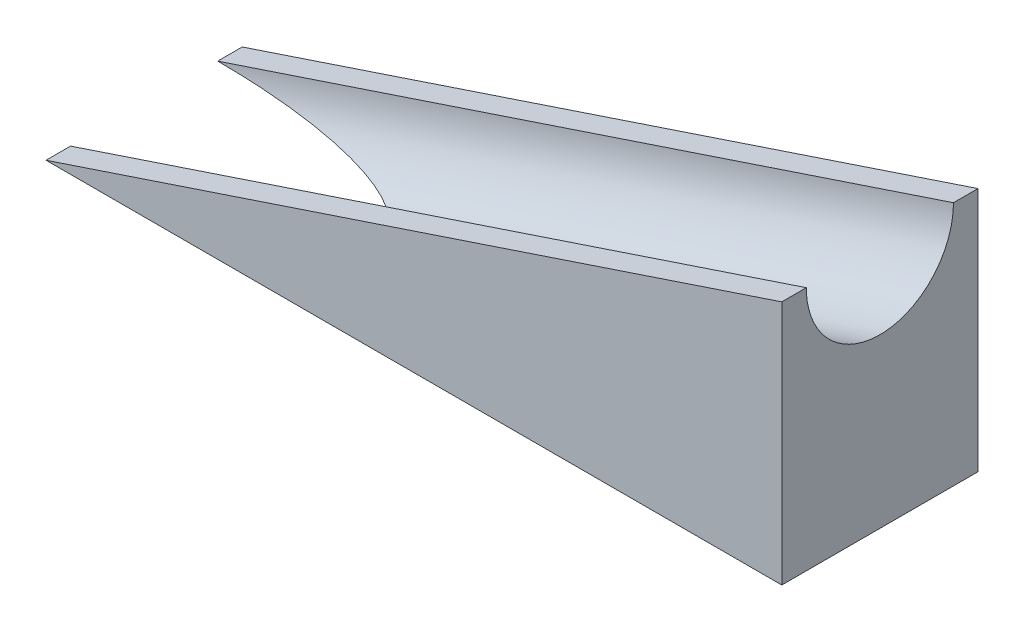
ISO-10303-21;
HEADER;
FILE_DESCRIPTION(('STEP AP214'),'2;1');
FILE_NAME('part.step','',(''),(''),'','','');
FILE_SCHEMA(('AUTOMOTIVE_DESIGN { 1 0 10303 214 1 1 1 1 }'));
ENDSEC;
DATA;
#1=APPLICATION_CONTEXT('core data for automotive mechanical design processes');
#2=APPLICATION_PROTOCOL_DEFINITION('international standard','automotive_design',2000,#1);
#3=PRODUCT_CONTEXT('',#1,'mechanical');
#4=PRODUCT('Part','Part','',(#3));
#5=PRODUCT_RELATED_PRODUCT_CATEGORY('part','',(#4));
#6=PRODUCT_DEFINITION_FORMATION('','',#4);
#7=PRODUCT_DEFINITION_CONTEXT('part definition',#1,'design');
#8=PRODUCT_DEFINITION('design','',#6,#7);
#9=PRODUCT_DEFINITION_SHAPE('','',#8);
#10=(LENGTH_UNIT() NAMED_UNIT(*) SI_UNIT(.MILLI.,.METRE.));
#11=(NAMED_UNIT(*) PLANE_ANGLE_UNIT() SI_UNIT($,.RADIAN.));
#12=(NAMED_UNIT(*) SI_UNIT($,.STERADIAN.) SOLID_ANGLE_UNIT());
#13=UNCERTAINTY_MEASURE_WITH_UNIT(LENGTH_MEASURE(1.E-05),#10,'distance_accuracy_value','');
#14=(GEOMETRIC_REPRESENTATION_CONTEXT(3) GLOBAL_UNCERTAINTY_ASSIGNED_CONTEXT((#13)) GLOBAL_UNIT_ASSIGNED_CONTEXT((#10,
#11,#12)) REPRESENTATION_CONTEXT('',''));
#15=CARTESIAN_POINT('',(0.,0.,0.));
#16=DIRECTION('',(0.,0.,1.));
#17=DIRECTION('',(1.,0.,0.));
#18=AXIS2_PLACEMENT_3D('',#15,#16,#17);
#19=CARTESIAN_POINT('',(150.,50.,40.));
#20=DIRECTION('',(0.316227766016838,-0.948683298050514,0.));
#21=DIRECTION('',(0.948683298050514,0.316227766016838,0.));
#22=AXIS2_PLACEMENT_3D('',#19,#20,#21);
#23=PLANE('',#22);
#24=DIRECTION('',(0.,0.,-1.));
#25=VECTOR('',#24,1.);
#26=CARTESIAN_POINT('',(150.,50.,40.));
#27=LINE('',#26,#25);
#28=CARTESIAN_POINT('',(150.,50.,40.));
#29=VERTEX_POINT('',#28);
#30=CARTESIAN_POINT('',(150.,50.,35.));
#31=VERTEX_POINT('',#30);
#32=EDGE_CURVE('E120',#29,#31,#27,.T.);
#33=ORIENTED_EDGE('',*,*,#32,.T.);
#34=DIRECTION('',(-0.948683298050514,-0.316227766016838,0.));
#35=VECTOR('',#34,1.);
#36=CARTESIAN_POINT('',(155.748623440674,51.916207813558,35.));
#37=LINE('',#36,#35);
#38=CARTESIAN_POINT('',(0.,0.,35.));
#39=VERTEX_POINT('',#38);
#40=EDGE_CURVE('E11',#31,#39,#37,.T.);
#41=ORIENTED_EDGE('',*,*,#40,.T.);
#42=DIRECTION('',(0.,0.,-1.));
#43=VECTOR('',#42,1.);
#44=CARTESIAN_POINT('',(0.,0.,40.));
#45=LINE('',#44,#43);
#46=CARTESIAN_POINT('',(0.,0.,40.));
#47=VERTEX_POINT('',#46);
#48=EDGE_CURVE('E103',#47,#39,#45,.T.);
#49=ORIENTED_EDGE('',*,*,#48,.F.);
#50=DIRECTION('',(-0.948683298050514,-0.316227766016838,0.));
#51=VECTOR('',#50,1.);
#52=CARTESIAN_POINT('',(150.,50.,40.));
#53=LINE('',#52,#51);
#54=EDGE_CURVE('E64',#29,#47,#53,.T.);
#55=ORIENTED_EDGE('',*,*,#54,.F.);
#56=EDGE_LOOP('',(#33,#41,#49,#55));
#57=FACE_BOUND('',#56,.T.);
#58=ADVANCED_FACE('F39',(#57),#23,.F.);
#59=CARTESIAN_POINT('',(0.,0.,40.));
#60=DIRECTION('',(0.,1.,0.));
#61=DIRECTION('',(0.,0.,1.));
#62=AXIS2_PLACEMENT_3D('',#59,#60,#61);
#63=PLANE('',#62);
#64=ORIENTED_EDGE('',*,*,#48,.T.);
#65=CARTESIAN_POINT('',(-5.27355936696949E-13,0.,20.));
#66=DIRECTION('',(0.,1.,0.));
#67=DIRECTION('',(-1.,0.,0.));
#68=AXIS2_PLACEMENT_3D('',#65,#66,#67);
#69=ELLIPSE('',#68,47.4341649025257,15.);
#70=CARTESIAN_POINT('',(0.,0.,5.));
#71=VERTEX_POINT('',#70);
#72=EDGE_CURVE('E96',#71,#39,#69,.F.);
#73=ORIENTED_EDGE('',*,*,#72,.F.);
#74=CARTESIAN_POINT('',(0.,0.,0.));
#75=VERTEX_POINT('',#74);
#76=EDGE_CURVE('E82',#71,#75,#45,.T.);
#77=ORIENTED_EDGE('',*,*,#76,.T.);
#78=DIRECTION('',(1.,0.,0.));
#79=VECTOR('',#78,1.);
#80=CARTESIAN_POINT('',(0.,0.,0.));
#81=LINE('',#80,#79);
#82=CARTESIAN_POINT('',(150.,0.,0.));
#83=VERTEX_POINT('',#82);
#84=EDGE_CURVE('E105',#75,#83,#81,.T.);
#85=ORIENTED_EDGE('',*,*,#84,.T.);
#86=DIRECTION('',(0.,0.,-1.));
#87=VECTOR('',#86,1.);
#88=CARTESIAN_POINT('',(150.,0.,40.));
#89=LINE('',#88,#87);
#90=CARTESIAN_POINT('',(150.,0.,40.));
#91=VERTEX_POINT('',#90);
#92=EDGE_CURVE('E100',#91,#83,#89,.T.);
#93=ORIENTED_EDGE('',*,*,#92,.F.);
#94=DIRECTION('',(1.,0.,0.));
#95=VECTOR('',#94,1.);
#96=CARTESIAN_POINT('',(0.,0.,40.));
#97=LINE('',#96,#95);
#98=EDGE_CURVE('E136',#47,#91,#97,.T.);
#99=ORIENTED_EDGE('',*,*,#98,.F.);
#100=EDGE_LOOP('',(#64,#73,#77,#85,#93,#99));
#101=FACE_BOUND('',#100,.T.);
#102=ADVANCED_FACE('F41',(#101),#63,.F.);
#103=CARTESIAN_POINT('',(150.,0.,40.));
#104=DIRECTION('',(-1.,0.,0.));
#105=DIRECTION('',(0.,0.,1.));
#106=AXIS2_PLACEMENT_3D('',#103,#104,#105);
#107=PLANE('',#106);
#108=CARTESIAN_POINT('',(150.,50.,5.));
#109=VERTEX_POINT('',#108);
#110=CARTESIAN_POINT('',(150.,50.,0.));
#111=VERTEX_POINT('',#110);
#112=EDGE_CURVE('E115',#109,#111,#27,.T.);
#113=ORIENTED_EDGE('',*,*,#112,.F.);
#114=CARTESIAN_POINT('',(150.,50.0000000000002,20.));
#115=DIRECTION('',(-1.,0.,0.));
#116=DIRECTION('',(0.,-1.,0.));
#117=AXIS2_PLACEMENT_3D('',#114,#115,#116);
#118=ELLIPSE('',#117,15.8113883008419,15.);
#119=EDGE_CURVE('E55',#31,#109,#118,.F.);
#120=ORIENTED_EDGE('',*,*,#119,.F.);
#121=ORIENTED_EDGE('',*,*,#32,.F.);
#122=DIRECTION('',(0.,1.,0.));
#123=VECTOR('',#122,1.);
#124=CARTESIAN_POINT('',(150.,0.,40.));
#125=LINE('',#124,#123);
#126=EDGE_CURVE('E88',#91,#29,#125,.T.);
#127=ORIENTED_EDGE('',*,*,#126,.F.);
#128=ORIENTED_EDGE('',*,*,#92,.T.);
#129=DIRECTION('',(0.,1.,0.));
#130=VECTOR('',#129,1.);
#131=CARTESIAN_POINT('',(150.,0.,0.));
#132=LINE('',#131,#130);
#133=EDGE_CURVE('E128',#83,#111,#132,.T.);
#134=ORIENTED_EDGE('',*,*,#133,.T.);
#135=EDGE_LOOP('',(#113,#120,#121,#127,#128,#134));
#136=FACE_BOUND('',#135,.T.);
#137=ADVANCED_FACE('F127',(#136),#107,.F.);
#138=ORIENTED_EDGE('',*,*,#76,.F.);
#139=DIRECTION('',(-0.948683298050514,-0.316227766016838,0.));
#140=VECTOR('',#139,1.);
#141=CARTESIAN_POINT('',(155.748623440674,51.916207813558,5.));
#142=LINE('',#141,#140);
#143=EDGE_CURVE('E48',#71,#109,#142,.F.);
#144=ORIENTED_EDGE('',*,*,#143,.T.);
#145=ORIENTED_EDGE('',*,*,#112,.T.);
#146=DIRECTION('',(-0.948683298050514,-0.316227766016838,0.));
#147=VECTOR('',#146,1.);
#148=CARTESIAN_POINT('',(150.,50.,0.));
#149=LINE('',#148,#147);
#150=EDGE_CURVE('E109',#111,#75,#149,.T.);
#151=ORIENTED_EDGE('',*,*,#150,.T.);
#152=EDGE_LOOP('',(#138,#144,#145,#151));
#153=FACE_BOUND('',#152,.T.);
#154=ADVANCED_FACE('F107',(#153),#23,.F.);
#155=CARTESIAN_POINT('',(0.,0.,40.));
#156=DIRECTION('',(0.,0.,1.));
#157=DIRECTION('',(1.,0.,0.));
#158=AXIS2_PLACEMENT_3D('',#155,#156,#157);
#159=PLANE('',#158);
#160=ORIENTED_EDGE('',*,*,#98,.T.);
#161=ORIENTED_EDGE('',*,*,#126,.T.);
#162=ORIENTED_EDGE('',*,*,#54,.T.);
#163=EDGE_LOOP('',(#160,#161,#162));
#164=FACE_BOUND('',#163,.T.);
#165=ADVANCED_FACE('F141',(#164),#159,.T.);
#166=CARTESIAN_POINT('',(0.,0.,0.));
#167=DIRECTION('',(0.,0.,1.));
#168=DIRECTION('',(1.,0.,0.));
#169=AXIS2_PLACEMENT_3D('',#166,#167,#168);
#170=PLANE('',#169);
#171=ORIENTED_EDGE('',*,*,#84,.F.);
#172=ORIENTED_EDGE('',*,*,#150,.F.);
#173=ORIENTED_EDGE('',*,*,#133,.F.);
#174=EDGE_LOOP('',(#171,#172,#173));
#175=FACE_BOUND('',#174,.T.);
#176=ADVANCED_FACE('F154',(#175),#170,.F.);
#177=CARTESIAN_POINT('',(155.748623440674,51.9162078135582,20.));
#178=DIRECTION('',(-0.948683298050514,-0.316227766016838,0.));
#179=DIRECTION('',(0.316227766016838,-0.948683298050514,0.));
#180=AXIS2_PLACEMENT_3D('',#177,#178,#179);
#181=CYLINDRICAL_SURFACE('',#180,15.);
#182=ORIENTED_EDGE('',*,*,#119,.T.);
#183=ORIENTED_EDGE('',*,*,#143,.F.);
#184=ORIENTED_EDGE('',*,*,#72,.T.);
#185=ORIENTED_EDGE('',*,*,#40,.F.);
#186=EDGE_LOOP('',(#182,#183,#184,#185));
#187=FACE_BOUND('',#186,.T.);
#188=ADVANCED_FACE('F95',(#187),#181,.F.);
#189=CLOSED_SHELL('',(#58,#102,#137,#154,#165,#176,#188));
#190=MANIFOLD_SOLID_BREP('B2',#189);
#191=ADVANCED_BREP_SHAPE_REPRESENTATION('',(#18,#190),#14);
#192=SHAPE_DEFINITION_REPRESENTATION(#9,#191);
ENDSEC;
END-ISO-10303-21;
